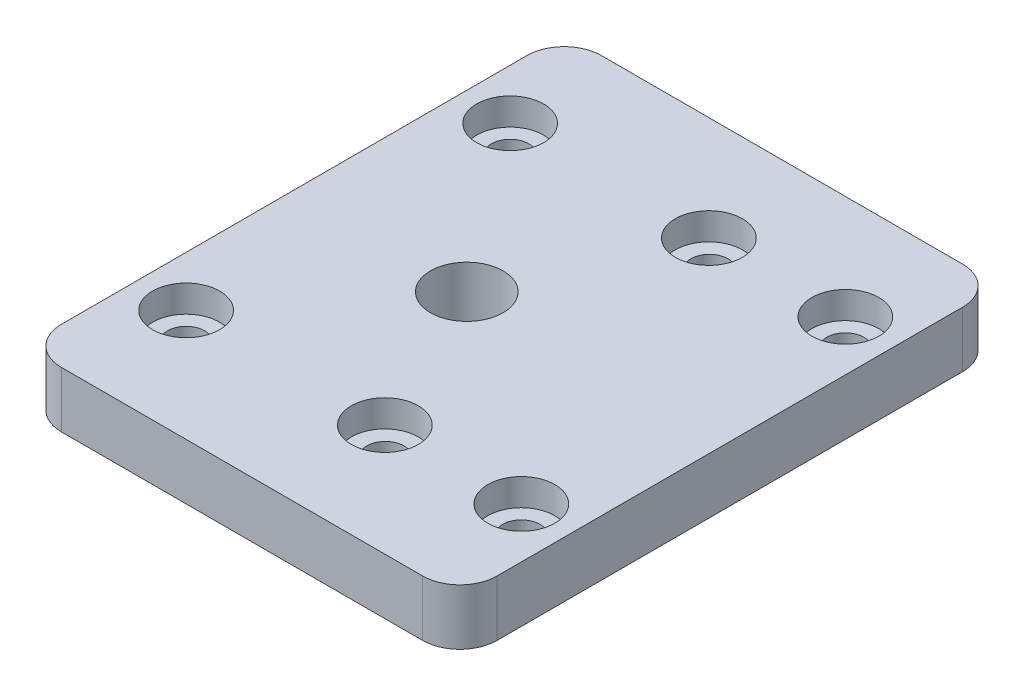
ISO-10303-21;
HEADER;
FILE_DESCRIPTION(('STEP AP214'),'2;1');
FILE_NAME('part.step','',(''),(''),'','','');
FILE_SCHEMA(('AUTOMOTIVE_DESIGN { 1 0 10303 214 1 1 1 1 }'));
ENDSEC;
DATA;
#1=APPLICATION_CONTEXT('core data for automotive mechanical design processes');
#2=APPLICATION_PROTOCOL_DEFINITION('international standard','automotive_design',2000,#1);
#3=PRODUCT_CONTEXT('',#1,'mechanical');
#4=PRODUCT('Part','Part','',(#3));
#5=PRODUCT_RELATED_PRODUCT_CATEGORY('part','',(#4));
#6=PRODUCT_DEFINITION_FORMATION('','',#4);
#7=PRODUCT_DEFINITION_CONTEXT('part definition',#1,'design');
#8=PRODUCT_DEFINITION('design','',#6,#7);
#9=PRODUCT_DEFINITION_SHAPE('','',#8);
#10=(LENGTH_UNIT() NAMED_UNIT(*) SI_UNIT(.MILLI.,.METRE.));
#11=(NAMED_UNIT(*) PLANE_ANGLE_UNIT() SI_UNIT($,.RADIAN.));
#12=(NAMED_UNIT(*) SI_UNIT($,.STERADIAN.) SOLID_ANGLE_UNIT());
#13=UNCERTAINTY_MEASURE_WITH_UNIT(LENGTH_MEASURE(1.E-05),#10,'distance_accuracy_value','');
#14=(GEOMETRIC_REPRESENTATION_CONTEXT(3) GLOBAL_UNCERTAINTY_ASSIGNED_CONTEXT((#13)) GLOBAL_UNIT_ASSIGNED_CONTEXT((#10,
#11,#12)) REPRESENTATION_CONTEXT('',''));
#15=CARTESIAN_POINT('',(0.,0.,0.));
#16=DIRECTION('',(0.,0.,1.));
#17=DIRECTION('',(1.,0.,0.));
#18=AXIS2_PLACEMENT_3D('',#15,#16,#17);
#19=CARTESIAN_POINT('',(1.7,0.,-8.9));
#20=DIRECTION('',(0.,1.,0.));
#21=DIRECTION('',(0.,0.,1.));
#22=AXIS2_PLACEMENT_3D('',#19,#20,#21);
#23=CYLINDRICAL_SURFACE('',#22,0.999999999999999);
#24=CARTESIAN_POINT('',(1.7,0.,-8.9));
#25=DIRECTION('',(0.,1.,0.));
#26=DIRECTION('',(0.,0.,1.));
#27=AXIS2_PLACEMENT_3D('',#24,#25,#26);
#28=CIRCLE('',#27,0.999999999999999);
#29=CARTESIAN_POINT('',(1.7,0.,-7.9));
#30=VERTEX_POINT('',#29);
#31=EDGE_CURVE('E190',#30,#30,#28,.T.);
#32=ORIENTED_EDGE('',*,*,#31,.F.);
#33=EDGE_LOOP('',(#32));
#34=FACE_BOUND('',#33,.T.);
#35=CARTESIAN_POINT('',(1.7,1.55,-8.9));
#36=DIRECTION('',(0.,1.,0.));
#37=DIRECTION('',(0.,0.,1.));
#38=AXIS2_PLACEMENT_3D('',#35,#36,#37);
#39=CIRCLE('',#38,0.999999999999999);
#40=CARTESIAN_POINT('',(1.7,1.55,-7.9));
#41=VERTEX_POINT('',#40);
#42=EDGE_CURVE('E21',#41,#41,#39,.F.);
#43=ORIENTED_EDGE('',*,*,#42,.F.);
#44=EDGE_LOOP('',(#43));
#45=FACE_BOUND('',#44,.T.);
#46=ADVANCED_FACE('F17',(#34,#45),#23,.F.);
#47=CARTESIAN_POINT('',(9.,1.55,-8.9));
#48=DIRECTION('',(0.,-1.,0.));
#49=DIRECTION('',(0.,0.,-1.));
#50=AXIS2_PLACEMENT_3D('',#47,#48,#49);
#51=CYLINDRICAL_SURFACE('',#50,1.);
#52=CARTESIAN_POINT('',(9.,1.55,-8.9));
#53=DIRECTION('',(0.,-1.,0.));
#54=DIRECTION('',(0.,0.,-1.));
#55=AXIS2_PLACEMENT_3D('',#52,#53,#54);
#56=CIRCLE('',#55,1.);
#57=CARTESIAN_POINT('',(9.,1.55,-9.9));
#58=VERTEX_POINT('',#57);
#59=EDGE_CURVE('E201',#58,#58,#56,.T.);
#60=ORIENTED_EDGE('',*,*,#59,.F.);
#61=EDGE_LOOP('',(#60));
#62=FACE_BOUND('',#61,.T.);
#63=CARTESIAN_POINT('',(9.,0.,-8.9));
#64=DIRECTION('',(0.,-1.,0.));
#65=DIRECTION('',(0.,0.,-1.));
#66=AXIS2_PLACEMENT_3D('',#63,#64,#65);
#67=CIRCLE('',#66,1.);
#68=CARTESIAN_POINT('',(9.,0.,-9.9));
#69=VERTEX_POINT('',#68);
#70=EDGE_CURVE('E187',#69,#69,#67,.F.);
#71=ORIENTED_EDGE('',*,*,#70,.F.);
#72=EDGE_LOOP('',(#71));
#73=FACE_BOUND('',#72,.T.);
#74=ADVANCED_FACE('F212',(#62,#73),#51,.F.);
#75=CARTESIAN_POINT('',(9.,1.55,8.5));
#76=DIRECTION('',(0.,-1.,0.));
#77=DIRECTION('',(0.,0.,-1.));
#78=AXIS2_PLACEMENT_3D('',#75,#76,#77);
#79=CYLINDRICAL_SURFACE('',#78,1.);
#80=CARTESIAN_POINT('',(9.,1.55,8.5));
#81=DIRECTION('',(0.,-1.,0.));
#82=DIRECTION('',(0.,0.,-1.));
#83=AXIS2_PLACEMENT_3D('',#80,#81,#82);
#84=CIRCLE('',#83,1.);
#85=CARTESIAN_POINT('',(9.,1.55,7.5));
#86=VERTEX_POINT('',#85);
#87=EDGE_CURVE('E199',#86,#86,#84,.T.);
#88=ORIENTED_EDGE('',*,*,#87,.F.);
#89=EDGE_LOOP('',(#88));
#90=FACE_BOUND('',#89,.T.);
#91=CARTESIAN_POINT('',(9.,0.,8.5));
#92=DIRECTION('',(0.,-1.,0.));
#93=DIRECTION('',(0.,0.,-1.));
#94=AXIS2_PLACEMENT_3D('',#91,#92,#93);
#95=CIRCLE('',#94,1.);
#96=CARTESIAN_POINT('',(9.,0.,7.5));
#97=VERTEX_POINT('',#96);
#98=EDGE_CURVE('E184',#97,#97,#95,.F.);
#99=ORIENTED_EDGE('',*,*,#98,.F.);
#100=EDGE_LOOP('',(#99));
#101=FACE_BOUND('',#100,.T.);
#102=ADVANCED_FACE('F219',(#90,#101),#79,.F.);
#103=CARTESIAN_POINT('',(-9.,1.55,8.5));
#104=DIRECTION('',(0.,-1.,0.));
#105=DIRECTION('',(0.,0.,-1.));
#106=AXIS2_PLACEMENT_3D('',#103,#104,#105);
#107=CYLINDRICAL_SURFACE('',#106,1.);
#108=CARTESIAN_POINT('',(-9.,1.55,8.5));
#109=DIRECTION('',(0.,-1.,0.));
#110=DIRECTION('',(0.,0.,-1.));
#111=AXIS2_PLACEMENT_3D('',#108,#109,#110);
#112=CIRCLE('',#111,1.);
#113=CARTESIAN_POINT('',(-9.,1.55,7.5));
#114=VERTEX_POINT('',#113);
#115=EDGE_CURVE('E193',#114,#114,#112,.T.);
#116=ORIENTED_EDGE('',*,*,#115,.F.);
#117=EDGE_LOOP('',(#116));
#118=FACE_BOUND('',#117,.T.);
#119=CARTESIAN_POINT('',(-9.,0.,8.5));
#120=DIRECTION('',(0.,-1.,0.));
#121=DIRECTION('',(0.,0.,-1.));
#122=AXIS2_PLACEMENT_3D('',#119,#120,#121);
#123=CIRCLE('',#122,1.);
#124=CARTESIAN_POINT('',(-9.,0.,7.5));
#125=VERTEX_POINT('',#124);
#126=EDGE_CURVE('E181',#125,#125,#123,.F.);
#127=ORIENTED_EDGE('',*,*,#126,.F.);
#128=EDGE_LOOP('',(#127));
#129=FACE_BOUND('',#128,.T.);
#130=ADVANCED_FACE('F283',(#118,#129),#107,.F.);
#131=CARTESIAN_POINT('',(1.7,1.55,8.5));
#132=DIRECTION('',(0.,-1.,0.));
#133=DIRECTION('',(0.,0.,-1.));
#134=AXIS2_PLACEMENT_3D('',#131,#132,#133);
#135=CYLINDRICAL_SURFACE('',#134,1.);
#136=CARTESIAN_POINT('',(1.7,1.55,8.5));
#137=DIRECTION('',(0.,-1.,0.));
#138=DIRECTION('',(0.,0.,-1.));
#139=AXIS2_PLACEMENT_3D('',#136,#137,#138);
#140=CIRCLE('',#139,1.);
#141=CARTESIAN_POINT('',(1.7,1.55,7.5));
#142=VERTEX_POINT('',#141);
#143=EDGE_CURVE('E196',#142,#142,#140,.T.);
#144=ORIENTED_EDGE('',*,*,#143,.F.);
#145=EDGE_LOOP('',(#144));
#146=FACE_BOUND('',#145,.T.);
#147=CARTESIAN_POINT('',(1.7,0.,8.5));
#148=DIRECTION('',(0.,-1.,0.));
#149=DIRECTION('',(0.,0.,-1.));
#150=AXIS2_PLACEMENT_3D('',#147,#148,#149);
#151=CIRCLE('',#150,1.);
#152=CARTESIAN_POINT('',(1.7,0.,7.5));
#153=VERTEX_POINT('',#152);
#154=EDGE_CURVE('E178',#153,#153,#151,.F.);
#155=ORIENTED_EDGE('',*,*,#154,.F.);
#156=EDGE_LOOP('',(#155));
#157=FACE_BOUND('',#156,.T.);
#158=ADVANCED_FACE('F280',(#146,#157),#135,.F.);
#159=CARTESIAN_POINT('',(-0.149777417,1.55,-10.7216));
#160=DIRECTION('',(0.,1.,0.));
#161=DIRECTION('',(0.,0.,1.));
#162=AXIS2_PLACEMENT_3D('',#159,#160,#161);
#163=PLANE('',#162);
#164=ORIENTED_EDGE('',*,*,#42,.T.);
#165=EDGE_LOOP('',(#164));
#166=FACE_BOUND('',#165,.T.);
#167=CARTESIAN_POINT('',(1.671822583,1.55,-8.9));
#168=DIRECTION('',(0.,1.,0.));
#169=DIRECTION('',(0.,0.,1.));
#170=AXIS2_PLACEMENT_3D('',#167,#168,#169);
#171=CIRCLE('',#170,1.8);
#172=CARTESIAN_POINT('',(1.671822583,1.55,-7.1));
#173=VERTEX_POINT('',#172);
#174=EDGE_CURVE('E100',#173,#173,#171,.F.);
#175=ORIENTED_EDGE('',*,*,#174,.F.);
#176=EDGE_LOOP('',(#175));
#177=FACE_BOUND('',#176,.T.);
#178=ADVANCED_FACE('F208',(#166,#177),#163,.T.);
#179=CARTESIAN_POINT('',(7.1784,1.55,-10.7216));
#180=DIRECTION('',(0.,1.,0.));
#181=DIRECTION('',(0.,0.,1.));
#182=AXIS2_PLACEMENT_3D('',#179,#180,#181);
#183=PLANE('',#182);
#184=ORIENTED_EDGE('',*,*,#59,.T.);
#185=EDGE_LOOP('',(#184));
#186=FACE_BOUND('',#185,.T.);
#187=CARTESIAN_POINT('',(9.,1.55,-8.9));
#188=DIRECTION('',(0.,1.,0.));
#189=DIRECTION('',(0.,0.,1.));
#190=AXIS2_PLACEMENT_3D('',#187,#188,#189);
#191=CIRCLE('',#190,1.8);
#192=CARTESIAN_POINT('',(9.,1.55,-7.1));
#193=VERTEX_POINT('',#192);
#194=EDGE_CURVE('E103',#193,#193,#191,.F.);
#195=ORIENTED_EDGE('',*,*,#194,.F.);
#196=EDGE_LOOP('',(#195));
#197=FACE_BOUND('',#196,.T.);
#198=ADVANCED_FACE('F494',(#186,#197),#183,.T.);
#199=CARTESIAN_POINT('',(7.1784,1.55,6.6784));
#200=DIRECTION('',(0.,1.,0.));
#201=DIRECTION('',(0.,0.,1.));
#202=AXIS2_PLACEMENT_3D('',#199,#200,#201);
#203=PLANE('',#202);
#204=ORIENTED_EDGE('',*,*,#87,.T.);
#205=EDGE_LOOP('',(#204));
#206=FACE_BOUND('',#205,.T.);
#207=CARTESIAN_POINT('',(9.,1.55,8.5));
#208=DIRECTION('',(0.,1.,0.));
#209=DIRECTION('',(0.,0.,1.));
#210=AXIS2_PLACEMENT_3D('',#207,#208,#209);
#211=CIRCLE('',#210,1.8);
#212=CARTESIAN_POINT('',(9.,1.55,10.3));
#213=VERTEX_POINT('',#212);
#214=EDGE_CURVE('E166',#213,#213,#211,.F.);
#215=ORIENTED_EDGE('',*,*,#214,.F.);
#216=EDGE_LOOP('',(#215));
#217=FACE_BOUND('',#216,.T.);
#218=ADVANCED_FACE('F485',(#206,#217),#203,.T.);
#219=CARTESIAN_POINT('',(-0.149777417,1.55,6.6784));
#220=DIRECTION('',(0.,1.,0.));
#221=DIRECTION('',(0.,0.,1.));
#222=AXIS2_PLACEMENT_3D('',#219,#220,#221);
#223=PLANE('',#222);
#224=ORIENTED_EDGE('',*,*,#143,.T.);
#225=EDGE_LOOP('',(#224));
#226=FACE_BOUND('',#225,.T.);
#227=CARTESIAN_POINT('',(1.671822583,1.55,8.5));
#228=DIRECTION('',(0.,1.,0.));
#229=DIRECTION('',(0.,0.,1.));
#230=AXIS2_PLACEMENT_3D('',#227,#228,#229);
#231=CIRCLE('',#230,1.8);
#232=CARTESIAN_POINT('',(1.671822583,1.55,10.3));
#233=VERTEX_POINT('',#232);
#234=EDGE_CURVE('E163',#233,#233,#231,.F.);
#235=ORIENTED_EDGE('',*,*,#234,.F.);
#236=EDGE_LOOP('',(#235));
#237=FACE_BOUND('',#236,.T.);
#238=ADVANCED_FACE('F476',(#226,#237),#223,.T.);
#239=CARTESIAN_POINT('',(-10.8216,1.55,6.6784));
#240=DIRECTION('',(0.,1.,0.));
#241=DIRECTION('',(0.,0.,1.));
#242=AXIS2_PLACEMENT_3D('',#239,#240,#241);
#243=PLANE('',#242);
#244=ORIENTED_EDGE('',*,*,#115,.T.);
#245=EDGE_LOOP('',(#244));
#246=FACE_BOUND('',#245,.T.);
#247=CARTESIAN_POINT('',(-9.,1.55,8.5));
#248=DIRECTION('',(0.,1.,0.));
#249=DIRECTION('',(0.,0.,1.));
#250=AXIS2_PLACEMENT_3D('',#247,#248,#249);
#251=CIRCLE('',#250,1.8);
#252=CARTESIAN_POINT('',(-9.,1.55,10.3));
#253=VERTEX_POINT('',#252);
#254=EDGE_CURVE('E160',#253,#253,#251,.F.);
#255=ORIENTED_EDGE('',*,*,#254,.F.);
#256=EDGE_LOOP('',(#255));
#257=FACE_BOUND('',#256,.T.);
#258=ADVANCED_FACE('F298',(#246,#257),#243,.T.);
#259=CARTESIAN_POINT('',(-11.7,0.,14.5));
#260=DIRECTION('',(0.,-1.,0.));
#261=DIRECTION('',(0.,0.,-1.));
#262=AXIS2_PLACEMENT_3D('',#259,#260,#261);
#263=PLANE('',#262);
#264=ORIENTED_EDGE('',*,*,#154,.T.);
#265=EDGE_LOOP('',(#264));
#266=FACE_BOUND('',#265,.T.);
#267=ORIENTED_EDGE('',*,*,#126,.T.);
#268=EDGE_LOOP('',(#267));
#269=FACE_BOUND('',#268,.T.);
#270=ORIENTED_EDGE('',*,*,#98,.T.);
#271=EDGE_LOOP('',(#270));
#272=FACE_BOUND('',#271,.T.);
#273=ORIENTED_EDGE('',*,*,#70,.T.);
#274=EDGE_LOOP('',(#273));
#275=FACE_BOUND('',#274,.T.);
#276=ORIENTED_EDGE('',*,*,#31,.T.);
#277=EDGE_LOOP('',(#276));
#278=FACE_BOUND('',#277,.T.);
#279=CARTESIAN_POINT('',(-9.,0.,-8.9));
#280=DIRECTION('',(0.,1.,0.));
#281=DIRECTION('',(0.,0.,1.));
#282=AXIS2_PLACEMENT_3D('',#279,#280,#281);
#283=CIRCLE('',#282,0.999999999999999);
#284=CARTESIAN_POINT('',(-9.,0.,-7.9));
#285=VERTEX_POINT('',#284);
#286=EDGE_CURVE('E91',#285,#285,#283,.F.);
#287=ORIENTED_EDGE('',*,*,#286,.F.);
#288=EDGE_LOOP('',(#287));
#289=FACE_BOUND('',#288,.T.);
#290=CARTESIAN_POINT('',(-2.328177417,0.,0.1));
#291=DIRECTION('',(0.,1.,0.));
#292=DIRECTION('',(0.,0.,1.));
#293=AXIS2_PLACEMENT_3D('',#290,#291,#292);
#294=CIRCLE('',#293,1.95);
#295=CARTESIAN_POINT('',(-2.328177417,0.,2.05));
#296=VERTEX_POINT('',#295);
#297=EDGE_CURVE('E157',#296,#296,#294,.F.);
#298=ORIENTED_EDGE('',*,*,#297,.F.);
#299=EDGE_LOOP('',(#298));
#300=FACE_BOUND('',#299,.T.);
#301=DIRECTION('',(0.,0.,-1.));
#302=VECTOR('',#301,1.);
#303=CARTESIAN_POINT('',(-11.7,0.,0.));
#304=LINE('',#303,#302);
#305=CARTESIAN_POINT('',(-11.7,0.,12.5));
#306=VERTEX_POINT('',#305);
#307=CARTESIAN_POINT('',(-11.7,0.,-12.4999999996153));
#308=VERTEX_POINT('',#307);
#309=EDGE_CURVE('E113',#306,#308,#304,.T.);
#310=ORIENTED_EDGE('',*,*,#309,.T.);
#311=CARTESIAN_POINT('',(-9.7,0.,-12.5));
#312=DIRECTION('',(0.,-1.,0.));
#313=DIRECTION('',(0.,0.,-1.));
#314=AXIS2_PLACEMENT_3D('',#311,#312,#313);
#315=CIRCLE('',#314,2.);
#316=CARTESIAN_POINT('',(-9.7,0.,-14.5));
#317=VERTEX_POINT('',#316);
#318=EDGE_CURVE('E172',#308,#317,#315,.T.);
#319=ORIENTED_EDGE('',*,*,#318,.T.);
#320=DIRECTION('',(1.,0.,0.));
#321=VECTOR('',#320,1.);
#322=CARTESIAN_POINT('',(0.,0.,-14.5));
#323=LINE('',#322,#321);
#324=CARTESIAN_POINT('',(9.7,0.,-14.5));
#325=VERTEX_POINT('',#324);
#326=EDGE_CURVE('E109',#317,#325,#323,.T.);
#327=ORIENTED_EDGE('',*,*,#326,.T.);
#328=CARTESIAN_POINT('',(9.7,0.,-12.5));
#329=DIRECTION('',(0.,-1.,0.));
#330=DIRECTION('',(0.,0.,-1.));
#331=AXIS2_PLACEMENT_3D('',#328,#329,#330);
#332=CIRCLE('',#331,2.);
#333=CARTESIAN_POINT('',(11.7,0.,-12.5));
#334=VERTEX_POINT('',#333);
#335=EDGE_CURVE('E96',#325,#334,#332,.T.);
#336=ORIENTED_EDGE('',*,*,#335,.T.);
#337=DIRECTION('',(0.,0.,1.));
#338=VECTOR('',#337,1.);
#339=CARTESIAN_POINT('',(11.7,0.,0.));
#340=LINE('',#339,#338);
#341=CARTESIAN_POINT('',(11.7,0.,12.5));
#342=VERTEX_POINT('',#341);
#343=EDGE_CURVE('E94',#334,#342,#340,.T.);
#344=ORIENTED_EDGE('',*,*,#343,.T.);
#345=CARTESIAN_POINT('',(9.7,0.,12.5));
#346=DIRECTION('',(0.,-1.,0.));
#347=DIRECTION('',(0.,0.,-1.));
#348=AXIS2_PLACEMENT_3D('',#345,#346,#347);
#349=CIRCLE('',#348,2.);
#350=CARTESIAN_POINT('',(9.7,0.,14.5));
#351=VERTEX_POINT('',#350);
#352=EDGE_CURVE('E82',#342,#351,#349,.T.);
#353=ORIENTED_EDGE('',*,*,#352,.T.);
#354=DIRECTION('',(-1.,0.,0.));
#355=VECTOR('',#354,1.);
#356=CARTESIAN_POINT('',(0.,0.,14.5));
#357=LINE('',#356,#355);
#358=CARTESIAN_POINT('',(-9.70000000041021,0.,14.5));
#359=VERTEX_POINT('',#358);
#360=EDGE_CURVE('E117',#351,#359,#357,.T.);
#361=ORIENTED_EDGE('',*,*,#360,.T.);
#362=CARTESIAN_POINT('',(-9.7,0.,12.5));
#363=DIRECTION('',(0.,-1.,0.));
#364=DIRECTION('',(0.,0.,-1.));
#365=AXIS2_PLACEMENT_3D('',#362,#363,#364);
#366=CIRCLE('',#365,2.);
#367=EDGE_CURVE('E174',#359,#306,#366,.T.);
#368=ORIENTED_EDGE('',*,*,#367,.T.);
#369=EDGE_LOOP('',(#310,#319,#327,#336,#344,#353,#361,#368));
#370=FACE_BOUND('',#369,.T.);
#371=ADVANCED_FACE('F98',(#266,#269,#272,#275,#278,#289,#300,#370),#263,.T.);
#372=CARTESIAN_POINT('',(-9.,0.,-8.9));
#373=DIRECTION('',(0.,1.,0.));
#374=DIRECTION('',(0.,0.,1.));
#375=AXIS2_PLACEMENT_3D('',#372,#373,#374);
#376=CYLINDRICAL_SURFACE('',#375,0.999999999999999);
#377=ORIENTED_EDGE('',*,*,#286,.T.);
#378=EDGE_LOOP('',(#377));
#379=FACE_BOUND('',#378,.T.);
#380=CARTESIAN_POINT('',(-9.,1.55,-8.9));
#381=DIRECTION('',(0.,1.,0.));
#382=DIRECTION('',(0.,0.,1.));
#383=AXIS2_PLACEMENT_3D('',#380,#381,#382);
#384=CIRCLE('',#383,0.999999999999999);
#385=CARTESIAN_POINT('',(-9.,1.55,-7.9));
#386=VERTEX_POINT('',#385);
#387=EDGE_CURVE('E154',#386,#386,#384,.F.);
#388=ORIENTED_EDGE('',*,*,#387,.F.);
#389=EDGE_LOOP('',(#388));
#390=FACE_BOUND('',#389,.T.);
#391=ADVANCED_FACE('F276',(#379,#390),#376,.F.);
#392=CARTESIAN_POINT('',(9.7,3.,12.5));
#393=DIRECTION('',(0.,-1.,0.));
#394=DIRECTION('',(0.,0.,-1.));
#395=AXIS2_PLACEMENT_3D('',#392,#393,#394);
#396=CYLINDRICAL_SURFACE('',#395,2.);
#397=DIRECTION('',(0.,-1.,0.));
#398=VECTOR('',#397,1.);
#399=CARTESIAN_POINT('',(9.7,1.5,14.5));
#400=LINE('',#399,#398);
#401=CARTESIAN_POINT('',(9.7,3.,14.5));
#402=VERTEX_POINT('',#401);
#403=EDGE_CURVE('E87',#402,#351,#400,.T.);
#404=ORIENTED_EDGE('',*,*,#403,.T.);
#405=ORIENTED_EDGE('',*,*,#352,.F.);
#406=DIRECTION('',(0.,1.,0.));
#407=VECTOR('',#406,1.);
#408=CARTESIAN_POINT('',(11.7,1.5,12.5));
#409=LINE('',#408,#407);
#410=CARTESIAN_POINT('',(11.7,3.,12.5));
#411=VERTEX_POINT('',#410);
#412=EDGE_CURVE('E86',#342,#411,#409,.T.);
#413=ORIENTED_EDGE('',*,*,#412,.T.);
#414=CARTESIAN_POINT('',(9.7,3.,12.5));
#415=DIRECTION('',(0.,-1.,0.));
#416=DIRECTION('',(0.,0.,-1.));
#417=AXIS2_PLACEMENT_3D('',#414,#415,#416);
#418=CIRCLE('',#417,2.);
#419=EDGE_CURVE('E152',#411,#402,#418,.T.);
#420=ORIENTED_EDGE('',*,*,#419,.T.);
#421=EDGE_LOOP('',(#404,#405,#413,#420));
#422=FACE_BOUND('',#421,.T.);
#423=ADVANCED_FACE('F84',(#422),#396,.T.);
#424=CARTESIAN_POINT('',(9.7,0.,14.5));
#425=DIRECTION('',(0.,0.,-1.));
#426=DIRECTION('',(-1.,0.,0.));
#427=AXIS2_PLACEMENT_3D('',#424,#425,#426);
#428=PLANE('',#427);
#429=ORIENTED_EDGE('',*,*,#403,.F.);
#430=DIRECTION('',(-1.,0.,0.));
#431=VECTOR('',#430,1.);
#432=CARTESIAN_POINT('',(0.,3.,14.5));
#433=LINE('',#432,#431);
#434=CARTESIAN_POINT('',(-9.70000000041021,3.,14.5));
#435=VERTEX_POINT('',#434);
#436=EDGE_CURVE('E151',#402,#435,#433,.T.);
#437=ORIENTED_EDGE('',*,*,#436,.T.);
#438=DIRECTION('',(0.,1.,0.));
#439=VECTOR('',#438,1.);
#440=CARTESIAN_POINT('',(-9.70000000082041,1.5,14.5));
#441=LINE('',#440,#439);
#442=EDGE_CURVE('E118',#435,#359,#441,.F.);
#443=ORIENTED_EDGE('',*,*,#442,.T.);
#444=ORIENTED_EDGE('',*,*,#360,.F.);
#445=EDGE_LOOP('',(#429,#437,#443,#444));
#446=FACE_BOUND('',#445,.T.);
#447=ADVANCED_FACE('F272',(#446),#428,.F.);
#448=CARTESIAN_POINT('',(-9.7,3.,12.5));
#449=DIRECTION('',(0.,-1.,0.));
#450=DIRECTION('',(0.,0.,-1.));
#451=AXIS2_PLACEMENT_3D('',#448,#449,#450);
#452=CYLINDRICAL_SURFACE('',#451,2.);
#453=DIRECTION('',(0.,-1.,0.));
#454=VECTOR('',#453,1.);
#455=CARTESIAN_POINT('',(-11.7,1.5,12.5));
#456=LINE('',#455,#454);
#457=CARTESIAN_POINT('',(-11.7,3.,12.5));
#458=VERTEX_POINT('',#457);
#459=EDGE_CURVE('E116',#458,#306,#456,.T.);
#460=ORIENTED_EDGE('',*,*,#459,.T.);
#461=ORIENTED_EDGE('',*,*,#367,.F.);
#462=ORIENTED_EDGE('',*,*,#442,.F.);
#463=CARTESIAN_POINT('',(-9.7,3.,12.5));
#464=DIRECTION('',(0.,-1.,0.));
#465=DIRECTION('',(0.,0.,-1.));
#466=AXIS2_PLACEMENT_3D('',#463,#464,#465);
#467=CIRCLE('',#466,2.);
#468=EDGE_CURVE('E148',#435,#458,#467,.T.);
#469=ORIENTED_EDGE('',*,*,#468,.T.);
#470=EDGE_LOOP('',(#460,#461,#462,#469));
#471=FACE_BOUND('',#470,.T.);
#472=ADVANCED_FACE('F269',(#471),#452,.T.);
#473=CARTESIAN_POINT('',(-11.7,0.,12.5));
#474=DIRECTION('',(1.,0.,0.));
#475=DIRECTION('',(0.,0.,-1.));
#476=AXIS2_PLACEMENT_3D('',#473,#474,#475);
#477=PLANE('',#476);
#478=ORIENTED_EDGE('',*,*,#459,.F.);
#479=DIRECTION('',(0.,0.,-1.));
#480=VECTOR('',#479,1.);
#481=CARTESIAN_POINT('',(-11.7,3.,0.));
#482=LINE('',#481,#480);
#483=CARTESIAN_POINT('',(-11.7,3.,-12.4999999996153));
#484=VERTEX_POINT('',#483);
#485=EDGE_CURVE('E147',#458,#484,#482,.T.);
#486=ORIENTED_EDGE('',*,*,#485,.T.);
#487=DIRECTION('',(0.,1.,0.));
#488=VECTOR('',#487,1.);
#489=CARTESIAN_POINT('',(-11.7,1.5,-12.4999999992306));
#490=LINE('',#489,#488);
#491=EDGE_CURVE('E115',#484,#308,#490,.F.);
#492=ORIENTED_EDGE('',*,*,#491,.T.);
#493=ORIENTED_EDGE('',*,*,#309,.F.);
#494=EDGE_LOOP('',(#478,#486,#492,#493));
#495=FACE_BOUND('',#494,.T.);
#496=ADVANCED_FACE('F267',(#495),#477,.F.);
#497=CARTESIAN_POINT('',(-9.7,3.,-12.5));
#498=DIRECTION('',(0.,-1.,0.));
#499=DIRECTION('',(0.,0.,-1.));
#500=AXIS2_PLACEMENT_3D('',#497,#498,#499);
#501=CYLINDRICAL_SURFACE('',#500,2.);
#502=DIRECTION('',(0.,-1.,0.));
#503=VECTOR('',#502,1.);
#504=CARTESIAN_POINT('',(-9.7,1.5,-14.5));
#505=LINE('',#504,#503);
#506=CARTESIAN_POINT('',(-9.7,3.,-14.5));
#507=VERTEX_POINT('',#506);
#508=EDGE_CURVE('E112',#507,#317,#505,.T.);
#509=ORIENTED_EDGE('',*,*,#508,.T.);
#510=ORIENTED_EDGE('',*,*,#318,.F.);
#511=ORIENTED_EDGE('',*,*,#491,.F.);
#512=CARTESIAN_POINT('',(-9.7,3.,-12.5));
#513=DIRECTION('',(0.,-1.,0.));
#514=DIRECTION('',(0.,0.,-1.));
#515=AXIS2_PLACEMENT_3D('',#512,#513,#514);
#516=CIRCLE('',#515,2.);
#517=EDGE_CURVE('E144',#484,#507,#516,.T.);
#518=ORIENTED_EDGE('',*,*,#517,.T.);
#519=EDGE_LOOP('',(#509,#510,#511,#518));
#520=FACE_BOUND('',#519,.T.);
#521=ADVANCED_FACE('F264',(#520),#501,.T.);
#522=CARTESIAN_POINT('',(-9.7,0.,-14.5));
#523=DIRECTION('',(0.,0.,1.));
#524=DIRECTION('',(1.,0.,0.));
#525=AXIS2_PLACEMENT_3D('',#522,#523,#524);
#526=PLANE('',#525);
#527=DIRECTION('',(0.,1.,0.));
#528=VECTOR('',#527,1.);
#529=CARTESIAN_POINT('',(9.7,1.5,-14.5));
#530=LINE('',#529,#528);
#531=CARTESIAN_POINT('',(9.7,3.,-14.5));
#532=VERTEX_POINT('',#531);
#533=EDGE_CURVE('E111',#532,#325,#530,.F.);
#534=ORIENTED_EDGE('',*,*,#533,.T.);
#535=ORIENTED_EDGE('',*,*,#326,.F.);
#536=ORIENTED_EDGE('',*,*,#508,.F.);
#537=DIRECTION('',(1.,0.,0.));
#538=VECTOR('',#537,1.);
#539=CARTESIAN_POINT('',(0.,3.,-14.5));
#540=LINE('',#539,#538);
#541=EDGE_CURVE('E143',#507,#532,#540,.T.);
#542=ORIENTED_EDGE('',*,*,#541,.T.);
#543=EDGE_LOOP('',(#534,#535,#536,#542));
#544=FACE_BOUND('',#543,.T.);
#545=ADVANCED_FACE('F262',(#544),#526,.F.);
#546=CARTESIAN_POINT('',(9.7,3.,-12.5));
#547=DIRECTION('',(0.,-1.,0.));
#548=DIRECTION('',(0.,0.,-1.));
#549=AXIS2_PLACEMENT_3D('',#546,#547,#548);
#550=CYLINDRICAL_SURFACE('',#549,2.);
#551=DIRECTION('',(0.,-1.,0.));
#552=VECTOR('',#551,1.);
#553=CARTESIAN_POINT('',(11.7,1.5,-12.5));
#554=LINE('',#553,#552);
#555=CARTESIAN_POINT('',(11.7,3.,-12.5));
#556=VERTEX_POINT('',#555);
#557=EDGE_CURVE('E36',#556,#334,#554,.T.);
#558=ORIENTED_EDGE('',*,*,#557,.T.);
#559=ORIENTED_EDGE('',*,*,#335,.F.);
#560=ORIENTED_EDGE('',*,*,#533,.F.);
#561=CARTESIAN_POINT('',(9.7,3.,-12.5));
#562=DIRECTION('',(0.,-1.,0.));
#563=DIRECTION('',(0.,0.,-1.));
#564=AXIS2_PLACEMENT_3D('',#561,#562,#563);
#565=CIRCLE('',#564,2.);
#566=EDGE_CURVE('E140',#532,#556,#565,.T.);
#567=ORIENTED_EDGE('',*,*,#566,.T.);
#568=EDGE_LOOP('',(#558,#559,#560,#567));
#569=FACE_BOUND('',#568,.T.);
#570=ADVANCED_FACE('F259',(#569),#550,.T.);
#571=CARTESIAN_POINT('',(11.7,0.,-12.5));
#572=DIRECTION('',(-1.,0.,0.));
#573=DIRECTION('',(0.,0.,1.));
#574=AXIS2_PLACEMENT_3D('',#571,#572,#573);
#575=PLANE('',#574);
#576=ORIENTED_EDGE('',*,*,#557,.F.);
#577=DIRECTION('',(0.,0.,1.));
#578=VECTOR('',#577,1.);
#579=CARTESIAN_POINT('',(11.7,3.,0.));
#580=LINE('',#579,#578);
#581=EDGE_CURVE('E95',#556,#411,#580,.T.);
#582=ORIENTED_EDGE('',*,*,#581,.T.);
#583=ORIENTED_EDGE('',*,*,#412,.F.);
#584=ORIENTED_EDGE('',*,*,#343,.F.);
#585=EDGE_LOOP('',(#576,#582,#583,#584));
#586=FACE_BOUND('',#585,.T.);
#587=ADVANCED_FACE('F93',(#586),#575,.F.);
#588=CARTESIAN_POINT('',(1.671822583,1.55,-8.9));
#589=DIRECTION('',(0.,1.,0.));
#590=DIRECTION('',(0.,0.,1.));
#591=AXIS2_PLACEMENT_3D('',#588,#589,#590);
#592=CYLINDRICAL_SURFACE('',#591,1.8);
#593=ORIENTED_EDGE('',*,*,#174,.T.);
#594=EDGE_LOOP('',(#593));
#595=FACE_BOUND('',#594,.T.);
#596=CARTESIAN_POINT('',(1.671822583,3.,-8.9));
#597=DIRECTION('',(0.,1.,0.));
#598=DIRECTION('',(0.,0.,1.));
#599=AXIS2_PLACEMENT_3D('',#596,#597,#598);
#600=CIRCLE('',#599,1.8);
#601=CARTESIAN_POINT('',(1.671822583,3.,-7.1));
#602=VERTEX_POINT('',#601);
#603=EDGE_CURVE('E137',#602,#602,#600,.T.);
#604=ORIENTED_EDGE('',*,*,#603,.T.);
#605=EDGE_LOOP('',(#604));
#606=FACE_BOUND('',#605,.T.);
#607=ADVANCED_FACE('F254',(#595,#606),#592,.F.);
#608=CARTESIAN_POINT('',(9.,1.55,-8.9));
#609=DIRECTION('',(0.,1.,0.));
#610=DIRECTION('',(0.,0.,1.));
#611=AXIS2_PLACEMENT_3D('',#608,#609,#610);
#612=CYLINDRICAL_SURFACE('',#611,1.8);
#613=ORIENTED_EDGE('',*,*,#194,.T.);
#614=EDGE_LOOP('',(#613));
#615=FACE_BOUND('',#614,.T.);
#616=CARTESIAN_POINT('',(9.,3.,-8.9));
#617=DIRECTION('',(0.,1.,0.));
#618=DIRECTION('',(0.,0.,1.));
#619=AXIS2_PLACEMENT_3D('',#616,#617,#618);
#620=CIRCLE('',#619,1.8);
#621=CARTESIAN_POINT('',(9.,3.,-7.1));
#622=VERTEX_POINT('',#621);
#623=EDGE_CURVE('E134',#622,#622,#620,.T.);
#624=ORIENTED_EDGE('',*,*,#623,.T.);
#625=EDGE_LOOP('',(#624));
#626=FACE_BOUND('',#625,.T.);
#627=ADVANCED_FACE('F250',(#615,#626),#612,.F.);
#628=CARTESIAN_POINT('',(9.,1.55,8.5));
#629=DIRECTION('',(0.,1.,0.));
#630=DIRECTION('',(0.,0.,1.));
#631=AXIS2_PLACEMENT_3D('',#628,#629,#630);
#632=CYLINDRICAL_SURFACE('',#631,1.8);
#633=ORIENTED_EDGE('',*,*,#214,.T.);
#634=EDGE_LOOP('',(#633));
#635=FACE_BOUND('',#634,.T.);
#636=CARTESIAN_POINT('',(9.,3.,8.5));
#637=DIRECTION('',(0.,1.,0.));
#638=DIRECTION('',(0.,0.,1.));
#639=AXIS2_PLACEMENT_3D('',#636,#637,#638);
#640=CIRCLE('',#639,1.8);
#641=CARTESIAN_POINT('',(9.,3.,10.3));
#642=VERTEX_POINT('',#641);
#643=EDGE_CURVE('E131',#642,#642,#640,.T.);
#644=ORIENTED_EDGE('',*,*,#643,.T.);
#645=EDGE_LOOP('',(#644));
#646=FACE_BOUND('',#645,.T.);
#647=ADVANCED_FACE('F246',(#635,#646),#632,.F.);
#648=CARTESIAN_POINT('',(1.671822583,1.55,8.5));
#649=DIRECTION('',(0.,1.,0.));
#650=DIRECTION('',(0.,0.,1.));
#651=AXIS2_PLACEMENT_3D('',#648,#649,#650);
#652=CYLINDRICAL_SURFACE('',#651,1.8);
#653=ORIENTED_EDGE('',*,*,#234,.T.);
#654=EDGE_LOOP('',(#653));
#655=FACE_BOUND('',#654,.T.);
#656=CARTESIAN_POINT('',(1.671822583,3.,8.5));
#657=DIRECTION('',(0.,1.,0.));
#658=DIRECTION('',(0.,0.,1.));
#659=AXIS2_PLACEMENT_3D('',#656,#657,#658);
#660=CIRCLE('',#659,1.8);
#661=CARTESIAN_POINT('',(1.671822583,3.,10.3));
#662=VERTEX_POINT('',#661);
#663=EDGE_CURVE('E128',#662,#662,#660,.T.);
#664=ORIENTED_EDGE('',*,*,#663,.T.);
#665=EDGE_LOOP('',(#664));
#666=FACE_BOUND('',#665,.T.);
#667=ADVANCED_FACE('F242',(#655,#666),#652,.F.);
#668=CARTESIAN_POINT('',(-9.,1.55,8.5));
#669=DIRECTION('',(0.,1.,0.));
#670=DIRECTION('',(0.,0.,1.));
#671=AXIS2_PLACEMENT_3D('',#668,#669,#670);
#672=CYLINDRICAL_SURFACE('',#671,1.8);
#673=ORIENTED_EDGE('',*,*,#254,.T.);
#674=EDGE_LOOP('',(#673));
#675=FACE_BOUND('',#674,.T.);
#676=CARTESIAN_POINT('',(-9.,3.,8.5));
#677=DIRECTION('',(0.,1.,0.));
#678=DIRECTION('',(0.,0.,1.));
#679=AXIS2_PLACEMENT_3D('',#676,#677,#678);
#680=CIRCLE('',#679,1.8);
#681=CARTESIAN_POINT('',(-9.,3.,10.3));
#682=VERTEX_POINT('',#681);
#683=EDGE_CURVE('E125',#682,#682,#680,.T.);
#684=ORIENTED_EDGE('',*,*,#683,.T.);
#685=EDGE_LOOP('',(#684));
#686=FACE_BOUND('',#685,.T.);
#687=ADVANCED_FACE('F238',(#675,#686),#672,.F.);
#688=CARTESIAN_POINT('',(-2.328177417,0.,0.1));
#689=DIRECTION('',(0.,1.,0.));
#690=DIRECTION('',(0.,0.,1.));
#691=AXIS2_PLACEMENT_3D('',#688,#689,#690);
#692=CYLINDRICAL_SURFACE('',#691,1.95);
#693=ORIENTED_EDGE('',*,*,#297,.T.);
#694=EDGE_LOOP('',(#693));
#695=FACE_BOUND('',#694,.T.);
#696=CARTESIAN_POINT('',(-2.328177417,3.,0.1));
#697=DIRECTION('',(0.,1.,0.));
#698=DIRECTION('',(0.,0.,1.));
#699=AXIS2_PLACEMENT_3D('',#696,#697,#698);
#700=CIRCLE('',#699,1.95);
#701=CARTESIAN_POINT('',(-2.328177417,3.,2.05));
#702=VERTEX_POINT('',#701);
#703=EDGE_CURVE('E122',#702,#702,#700,.T.);
#704=ORIENTED_EDGE('',*,*,#703,.T.);
#705=EDGE_LOOP('',(#704));
#706=FACE_BOUND('',#705,.T.);
#707=ADVANCED_FACE('F235',(#695,#706),#692,.F.);
#708=CARTESIAN_POINT('',(-10.8216,1.55,-10.7216));
#709=DIRECTION('',(0.,1.,0.));
#710=DIRECTION('',(0.,0.,1.));
#711=AXIS2_PLACEMENT_3D('',#708,#709,#710);
#712=PLANE('',#711);
#713=ORIENTED_EDGE('',*,*,#387,.T.);
#714=EDGE_LOOP('',(#713));
#715=FACE_BOUND('',#714,.T.);
#716=CARTESIAN_POINT('',(-9.,1.55,-8.9));
#717=DIRECTION('',(0.,1.,0.));
#718=DIRECTION('',(0.,0.,1.));
#719=AXIS2_PLACEMENT_3D('',#716,#717,#718);
#720=CIRCLE('',#719,1.8);
#721=CARTESIAN_POINT('',(-9.,1.55,-7.1));
#722=VERTEX_POINT('',#721);
#723=EDGE_CURVE('E27',#722,#722,#720,.F.);
#724=ORIENTED_EDGE('',*,*,#723,.F.);
#725=EDGE_LOOP('',(#724));
#726=FACE_BOUND('',#725,.T.);
#727=ADVANCED_FACE('F231',(#715,#726),#712,.T.);
#728=CARTESIAN_POINT('',(-11.7,3.,14.5));
#729=DIRECTION('',(0.,-1.,0.));
#730=DIRECTION('',(0.,0.,-1.));
#731=AXIS2_PLACEMENT_3D('',#728,#729,#730);
#732=PLANE('',#731);
#733=ORIENTED_EDGE('',*,*,#703,.F.);
#734=EDGE_LOOP('',(#733));
#735=FACE_BOUND('',#734,.T.);
#736=ORIENTED_EDGE('',*,*,#683,.F.);
#737=EDGE_LOOP('',(#736));
#738=FACE_BOUND('',#737,.T.);
#739=ORIENTED_EDGE('',*,*,#663,.F.);
#740=EDGE_LOOP('',(#739));
#741=FACE_BOUND('',#740,.T.);
#742=ORIENTED_EDGE('',*,*,#643,.F.);
#743=EDGE_LOOP('',(#742));
#744=FACE_BOUND('',#743,.T.);
#745=ORIENTED_EDGE('',*,*,#623,.F.);
#746=EDGE_LOOP('',(#745));
#747=FACE_BOUND('',#746,.T.);
#748=ORIENTED_EDGE('',*,*,#603,.F.);
#749=EDGE_LOOP('',(#748));
#750=FACE_BOUND('',#749,.T.);
#751=CARTESIAN_POINT('',(-9.,3.,-8.9));
#752=DIRECTION('',(0.,1.,0.));
#753=DIRECTION('',(0.,0.,1.));
#754=AXIS2_PLACEMENT_3D('',#751,#752,#753);
#755=CIRCLE('',#754,1.8);
#756=CARTESIAN_POINT('',(-9.,3.,-7.1));
#757=VERTEX_POINT('',#756);
#758=EDGE_CURVE('E11',#757,#757,#755,.T.);
#759=ORIENTED_EDGE('',*,*,#758,.F.);
#760=EDGE_LOOP('',(#759));
#761=FACE_BOUND('',#760,.T.);
#762=ORIENTED_EDGE('',*,*,#566,.F.);
#763=ORIENTED_EDGE('',*,*,#541,.F.);
#764=ORIENTED_EDGE('',*,*,#517,.F.);
#765=ORIENTED_EDGE('',*,*,#485,.F.);
#766=ORIENTED_EDGE('',*,*,#468,.F.);
#767=ORIENTED_EDGE('',*,*,#436,.F.);
#768=ORIENTED_EDGE('',*,*,#419,.F.);
#769=ORIENTED_EDGE('',*,*,#581,.F.);
#770=EDGE_LOOP('',(#762,#763,#764,#765,#766,#767,#768,#769));
#771=FACE_BOUND('',#770,.T.);
#772=ADVANCED_FACE('F19',(#735,#738,#741,#744,#747,#750,#761,#771),#732,.F.);
#773=CARTESIAN_POINT('',(-9.,1.55,-8.9));
#774=DIRECTION('',(0.,1.,0.));
#775=DIRECTION('',(0.,0.,1.));
#776=AXIS2_PLACEMENT_3D('',#773,#774,#775);
#777=CYLINDRICAL_SURFACE('',#776,1.8);
#778=ORIENTED_EDGE('',*,*,#723,.T.);
#779=EDGE_LOOP('',(#778));
#780=FACE_BOUND('',#779,.T.);
#781=ORIENTED_EDGE('',*,*,#758,.T.);
#782=EDGE_LOOP('',(#781));
#783=FACE_BOUND('',#782,.T.);
#784=ADVANCED_FACE('F224',(#780,#783),#777,.F.);
#785=CLOSED_SHELL('',(#46,#74,#102,#130,#158,#178,#198,#218,#238,#258,#371,#391,#423,#447,#472,
#496,#521,#545,#570,#587,#607,#627,#647,#667,#687,#707,#727,#772,#784));
#786=MANIFOLD_SOLID_BREP('B1',#785);
#787=ADVANCED_BREP_SHAPE_REPRESENTATION('',(#18,#786),#14);
#788=SHAPE_DEFINITION_REPRESENTATION(#9,#787);
ENDSEC;
END-ISO-10303-21;
